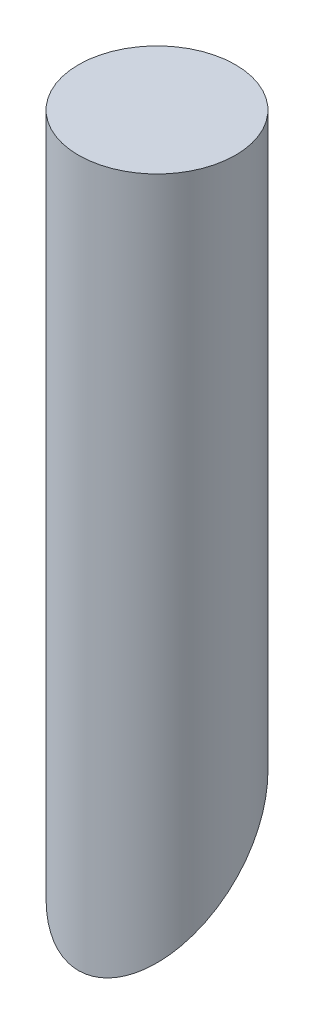
ISO-10303-21;
HEADER;
FILE_DESCRIPTION(('STEP AP214'),'2;1');
FILE_NAME('part.step','',(''),(''),'','','');
FILE_SCHEMA(('AUTOMOTIVE_DESIGN { 1 0 10303 214 1 1 1 1 }'));
ENDSEC;
DATA;
#1=APPLICATION_CONTEXT('core data for automotive mechanical design processes');
#2=APPLICATION_PROTOCOL_DEFINITION('international standard','automotive_design',2000,#1);
#3=PRODUCT_CONTEXT('',#1,'mechanical');
#4=PRODUCT('Part','Part','',(#3));
#5=PRODUCT_RELATED_PRODUCT_CATEGORY('part','',(#4));
#6=PRODUCT_DEFINITION_FORMATION('','',#4);
#7=PRODUCT_DEFINITION_CONTEXT('part definition',#1,'design');
#8=PRODUCT_DEFINITION('design','',#6,#7);
#9=PRODUCT_DEFINITION_SHAPE('','',#8);
#10=(LENGTH_UNIT() NAMED_UNIT(*) SI_UNIT(.MILLI.,.METRE.));
#11=(NAMED_UNIT(*) PLANE_ANGLE_UNIT() SI_UNIT($,.RADIAN.));
#12=(NAMED_UNIT(*) SI_UNIT($,.STERADIAN.) SOLID_ANGLE_UNIT());
#13=UNCERTAINTY_MEASURE_WITH_UNIT(LENGTH_MEASURE(1.E-05),#10,'distance_accuracy_value','');
#14=(GEOMETRIC_REPRESENTATION_CONTEXT(3) GLOBAL_UNCERTAINTY_ASSIGNED_CONTEXT((#13)) GLOBAL_UNIT_ASSIGNED_CONTEXT((#10,
#11,#12)) REPRESENTATION_CONTEXT('',''));
#15=CARTESIAN_POINT('',(0.,0.,0.));
#16=DIRECTION('',(0.,0.,1.));
#17=DIRECTION('',(1.,0.,0.));
#18=AXIS2_PLACEMENT_3D('',#15,#16,#17);
#19=CARTESIAN_POINT('',(0.,222.25,0.));
#20=DIRECTION('',(0.,-1.,0.));
#21=DIRECTION('',(0.,0.,-1.));
#22=AXIS2_PLACEMENT_3D('',#19,#20,#21);
#23=CYLINDRICAL_SURFACE('',#22,31.75);
#24=CARTESIAN_POINT('',(0.,222.25,0.));
#25=DIRECTION('',(0.,1.,0.));
#26=DIRECTION('',(0.,0.,1.));
#27=AXIS2_PLACEMENT_3D('',#24,#25,#26);
#28=CIRCLE('',#27,31.75);
#29=CARTESIAN_POINT('',(0.,222.25,31.75));
#30=VERTEX_POINT('',#29);
#31=EDGE_CURVE('E10',#30,#30,#28,.T.);
#32=ORIENTED_EDGE('',*,*,#31,.F.);
#33=EDGE_LOOP('',(#32));
#34=FACE_BOUND('',#33,.T.);
#35=CARTESIAN_POINT('',(0.,-31.75,0.));
#36=DIRECTION('',(0.,0.707106781186548,0.707106781186548));
#37=DIRECTION('',(0.,-0.707106781186548,0.707106781186548));
#38=AXIS2_PLACEMENT_3D('',#35,#36,#37);
#39=ELLIPSE('',#38,44.9012806053458,31.75);
#40=CARTESIAN_POINT('',(0.,-63.5,31.75));
#41=VERTEX_POINT('',#40);
#42=EDGE_CURVE('E36',#41,#41,#39,.T.);
#43=ORIENTED_EDGE('',*,*,#42,.T.);
#44=EDGE_LOOP('',(#43));
#45=FACE_BOUND('',#44,.T.);
#46=ADVANCED_FACE('F30',(#34,#45),#23,.T.);
#47=CARTESIAN_POINT('',(0.,222.25,0.));
#48=DIRECTION('',(0.,1.,0.));
#49=DIRECTION('',(0.,0.,1.));
#50=AXIS2_PLACEMENT_3D('',#47,#48,#49);
#51=PLANE('',#50);
#52=ORIENTED_EDGE('',*,*,#31,.T.);
#53=EDGE_LOOP('',(#52));
#54=FACE_BOUND('',#53,.T.);
#55=ADVANCED_FACE('F45',(#54),#51,.T.);
#56=CARTESIAN_POINT('',(-31.75,-15.875,-15.875));
#57=DIRECTION('',(0.,0.707106781186548,0.707106781186548));
#58=DIRECTION('',(0.,-0.707106781186548,0.707106781186548));
#59=AXIS2_PLACEMENT_3D('',#56,#57,#58);
#60=PLANE('',#59);
#61=ORIENTED_EDGE('',*,*,#42,.F.);
#62=EDGE_LOOP('',(#61));
#63=FACE_BOUND('',#62,.T.);
#64=ADVANCED_FACE('F43',(#63),#60,.F.);
#65=CLOSED_SHELL('',(#46,#55,#64));
#66=MANIFOLD_SOLID_BREP('B2',#65);
#67=ADVANCED_BREP_SHAPE_REPRESENTATION('',(#18,#66),#14);
#68=SHAPE_DEFINITION_REPRESENTATION(#9,#67);
ENDSEC;
END-ISO-10303-21;
